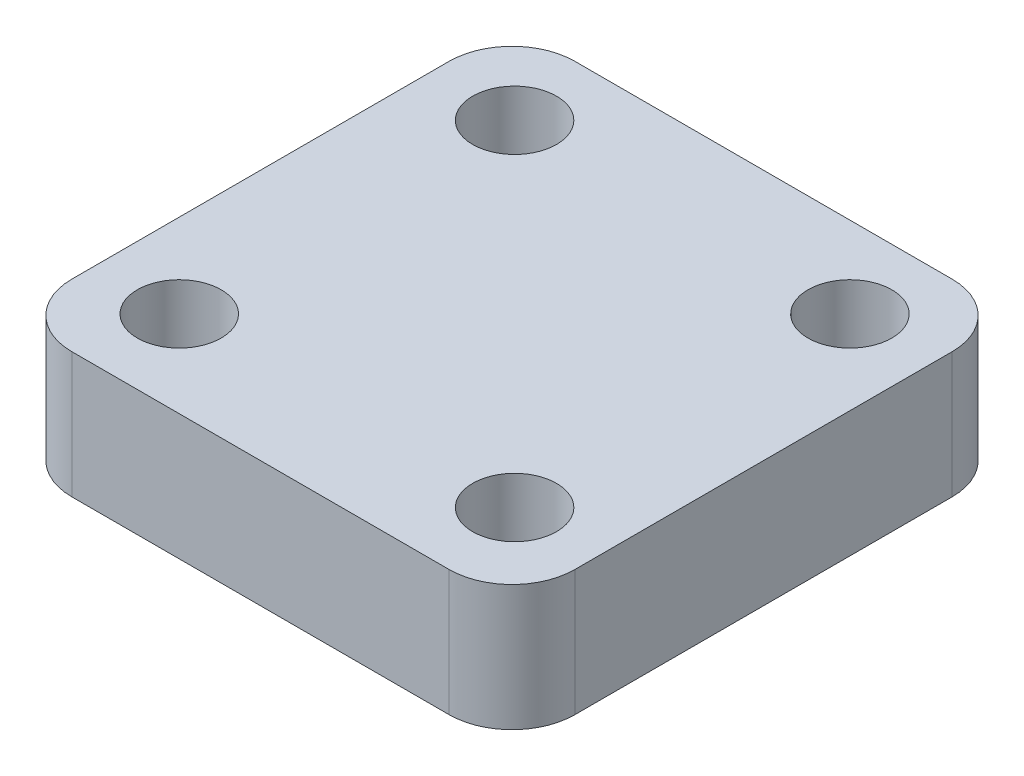
ISO-10303-21;
HEADER;
FILE_DESCRIPTION(('STEP AP214'),'2;1');
FILE_NAME('part.step','',(''),(''),'','','');
FILE_SCHEMA(('AUTOMOTIVE_DESIGN { 1 0 10303 214 1 1 1 1 }'));
ENDSEC;
DATA;
#1=APPLICATION_CONTEXT('core data for automotive mechanical design processes');
#2=APPLICATION_PROTOCOL_DEFINITION('international standard','automotive_design',2000,#1);
#3=PRODUCT_CONTEXT('',#1,'mechanical');
#4=PRODUCT('Part','Part','',(#3));
#5=PRODUCT_RELATED_PRODUCT_CATEGORY('part','',(#4));
#6=PRODUCT_DEFINITION_FORMATION('','',#4);
#7=PRODUCT_DEFINITION_CONTEXT('part definition',#1,'design');
#8=PRODUCT_DEFINITION('design','',#6,#7);
#9=PRODUCT_DEFINITION_SHAPE('','',#8);
#10=(LENGTH_UNIT() NAMED_UNIT(*) SI_UNIT(.MILLI.,.METRE.));
#11=(NAMED_UNIT(*) PLANE_ANGLE_UNIT() SI_UNIT($,.RADIAN.));
#12=(NAMED_UNIT(*) SI_UNIT($,.STERADIAN.) SOLID_ANGLE_UNIT());
#13=UNCERTAINTY_MEASURE_WITH_UNIT(LENGTH_MEASURE(1.E-05),#10,'distance_accuracy_value','');
#14=(GEOMETRIC_REPRESENTATION_CONTEXT(3) GLOBAL_UNCERTAINTY_ASSIGNED_CONTEXT((#13)) GLOBAL_UNIT_ASSIGNED_CONTEXT((#10,
#11,#12)) REPRESENTATION_CONTEXT('',''));
#15=CARTESIAN_POINT('',(0.,0.,0.));
#16=DIRECTION('',(0.,0.,1.));
#17=DIRECTION('',(1.,0.,0.));
#18=AXIS2_PLACEMENT_3D('',#15,#16,#17);
#19=CARTESIAN_POINT('',(450.,300.,-450.));
#20=DIRECTION('',(0.,1.,0.));
#21=DIRECTION('',(0.,0.,1.));
#22=AXIS2_PLACEMENT_3D('',#19,#20,#21);
#23=PLANE('',#22);
#24=CARTESIAN_POINT('',(-400.,300.,393.8285187875));
#25=DIRECTION('',(0.,1.,0.));
#26=DIRECTION('',(0.,0.,1.));
#27=AXIS2_PLACEMENT_3D('',#24,#25,#26);
#28=CIRCLE('',#27,100.);
#29=CARTESIAN_POINT('',(-400.,300.,493.8285187875));
#30=VERTEX_POINT('',#29);
#31=EDGE_CURVE('E188',#30,#30,#28,.T.);
#32=ORIENTED_EDGE('',*,*,#31,.F.);
#33=EDGE_LOOP('',(#32));
#34=FACE_BOUND('',#33,.T.);
#35=CARTESIAN_POINT('',(-400.,300.,-406.1714812125));
#36=DIRECTION('',(0.,1.,0.));
#37=DIRECTION('',(0.,0.,1.));
#38=AXIS2_PLACEMENT_3D('',#35,#36,#37);
#39=CIRCLE('',#38,100.);
#40=CARTESIAN_POINT('',(-400.,300.,-306.1714812125));
#41=VERTEX_POINT('',#40);
#42=EDGE_CURVE('E134',#41,#41,#39,.T.);
#43=ORIENTED_EDGE('',*,*,#42,.F.);
#44=EDGE_LOOP('',(#43));
#45=FACE_BOUND('',#44,.T.);
#46=CARTESIAN_POINT('',(450.,300.,-450.));
#47=DIRECTION('',(0.,1.,0.));
#48=DIRECTION('',(0.,0.,1.));
#49=AXIS2_PLACEMENT_3D('',#46,#47,#48);
#50=CIRCLE('',#49,150.);
#51=CARTESIAN_POINT('',(600.,300.,-449.999999999999));
#52=VERTEX_POINT('',#51);
#53=CARTESIAN_POINT('',(449.999999999999,300.,-600.));
#54=VERTEX_POINT('',#53);
#55=EDGE_CURVE('E145',#52,#54,#50,.T.);
#56=ORIENTED_EDGE('',*,*,#55,.T.);
#57=DIRECTION('',(-1.,0.,0.));
#58=VECTOR('',#57,1.);
#59=CARTESIAN_POINT('',(-449.999999999999,300.,-600.));
#60=LINE('',#59,#58);
#61=CARTESIAN_POINT('',(-450.,300.,-600.));
#62=VERTEX_POINT('',#61);
#63=EDGE_CURVE('E93',#54,#62,#60,.T.);
#64=ORIENTED_EDGE('',*,*,#63,.T.);
#65=CARTESIAN_POINT('',(-450.,300.,-450.));
#66=DIRECTION('',(0.,1.,0.));
#67=DIRECTION('',(0.,0.,-1.));
#68=AXIS2_PLACEMENT_3D('',#65,#66,#67);
#69=CIRCLE('',#68,150.);
#70=CARTESIAN_POINT('',(-600.,300.,-449.999999999999));
#71=VERTEX_POINT('',#70);
#72=EDGE_CURVE('E160',#62,#71,#69,.T.);
#73=ORIENTED_EDGE('',*,*,#72,.T.);
#74=DIRECTION('',(0.,0.,1.));
#75=VECTOR('',#74,1.);
#76=CARTESIAN_POINT('',(-600.,300.,-449.999999999999));
#77=LINE('',#76,#75);
#78=CARTESIAN_POINT('',(-600.,300.,449.999999999999));
#79=VERTEX_POINT('',#78);
#80=EDGE_CURVE('E173',#71,#79,#77,.T.);
#81=ORIENTED_EDGE('',*,*,#80,.T.);
#82=CARTESIAN_POINT('',(-450.,300.,450.));
#83=DIRECTION('',(0.,1.,0.));
#84=DIRECTION('',(0.,0.,1.));
#85=AXIS2_PLACEMENT_3D('',#82,#83,#84);
#86=CIRCLE('',#85,150.);
#87=CARTESIAN_POINT('',(-449.999999999999,300.,600.));
#88=VERTEX_POINT('',#87);
#89=EDGE_CURVE('E112',#79,#88,#86,.T.);
#90=ORIENTED_EDGE('',*,*,#89,.T.);
#91=DIRECTION('',(1.,0.,0.));
#92=VECTOR('',#91,1.);
#93=CARTESIAN_POINT('',(-449.999999999999,300.,600.));
#94=LINE('',#93,#92);
#95=CARTESIAN_POINT('',(449.999999999999,300.,600.));
#96=VERTEX_POINT('',#95);
#97=EDGE_CURVE('E106',#88,#96,#94,.T.);
#98=ORIENTED_EDGE('',*,*,#97,.T.);
#99=CARTESIAN_POINT('',(450.,300.,450.));
#100=DIRECTION('',(0.,1.,0.));
#101=DIRECTION('',(0.,0.,-1.));
#102=AXIS2_PLACEMENT_3D('',#99,#100,#101);
#103=CIRCLE('',#102,150.);
#104=CARTESIAN_POINT('',(600.,300.,449.999999999999));
#105=VERTEX_POINT('',#104);
#106=EDGE_CURVE('E110',#96,#105,#103,.T.);
#107=ORIENTED_EDGE('',*,*,#106,.T.);
#108=DIRECTION('',(0.,0.,-1.));
#109=VECTOR('',#108,1.);
#110=CARTESIAN_POINT('',(600.,300.,-449.999999999999));
#111=LINE('',#110,#109);
#112=EDGE_CURVE('E50',#105,#52,#111,.T.);
#113=ORIENTED_EDGE('',*,*,#112,.T.);
#114=EDGE_LOOP('',(#56,#64,#73,#81,#90,#98,#107,#113));
#115=FACE_BOUND('',#114,.T.);
#116=CARTESIAN_POINT('',(400.,300.,-406.1714812125));
#117=DIRECTION('',(0.,1.,0.));
#118=DIRECTION('',(0.,0.,1.));
#119=AXIS2_PLACEMENT_3D('',#116,#117,#118);
#120=CIRCLE('',#119,100.);
#121=CARTESIAN_POINT('',(400.,300.,-306.1714812125));
#122=VERTEX_POINT('',#121);
#123=EDGE_CURVE('E182',#122,#122,#120,.T.);
#124=ORIENTED_EDGE('',*,*,#123,.F.);
#125=EDGE_LOOP('',(#124));
#126=FACE_BOUND('',#125,.T.);
#127=CARTESIAN_POINT('',(400.,300.,393.8285187875));
#128=DIRECTION('',(0.,1.,0.));
#129=DIRECTION('',(0.,0.,1.));
#130=AXIS2_PLACEMENT_3D('',#127,#128,#129);
#131=CIRCLE('',#130,100.);
#132=CARTESIAN_POINT('',(400.,300.,493.8285187875));
#133=VERTEX_POINT('',#132);
#134=EDGE_CURVE('E194',#133,#133,#131,.T.);
#135=ORIENTED_EDGE('',*,*,#134,.F.);
#136=EDGE_LOOP('',(#135));
#137=FACE_BOUND('',#136,.T.);
#138=ADVANCED_FACE('F33',(#34,#45,#115,#126,#137),#23,.T.);
#139=CARTESIAN_POINT('',(450.,0.,-450.));
#140=DIRECTION('',(0.,1.,0.));
#141=DIRECTION('',(0.,0.,1.));
#142=AXIS2_PLACEMENT_3D('',#139,#140,#141);
#143=PLANE('',#142);
#144=CARTESIAN_POINT('',(450.,0.,-450.));
#145=DIRECTION('',(0.,1.,0.));
#146=DIRECTION('',(0.,0.,1.));
#147=AXIS2_PLACEMENT_3D('',#144,#145,#146);
#148=CIRCLE('',#147,150.);
#149=CARTESIAN_POINT('',(600.,0.,-449.999999999999));
#150=VERTEX_POINT('',#149);
#151=CARTESIAN_POINT('',(449.999999999999,0.,-600.));
#152=VERTEX_POINT('',#151);
#153=EDGE_CURVE('E130',#150,#152,#148,.T.);
#154=ORIENTED_EDGE('',*,*,#153,.F.);
#155=DIRECTION('',(0.,0.,-1.));
#156=VECTOR('',#155,1.);
#157=CARTESIAN_POINT('',(600.,0.,-449.999999999999));
#158=LINE('',#157,#156);
#159=CARTESIAN_POINT('',(600.,0.,449.999999999999));
#160=VERTEX_POINT('',#159);
#161=EDGE_CURVE('E85',#160,#150,#158,.T.);
#162=ORIENTED_EDGE('',*,*,#161,.F.);
#163=CARTESIAN_POINT('',(450.,0.,450.));
#164=DIRECTION('',(0.,1.,0.));
#165=DIRECTION('',(0.,0.,-1.));
#166=AXIS2_PLACEMENT_3D('',#163,#164,#165);
#167=CIRCLE('',#166,150.);
#168=CARTESIAN_POINT('',(449.999999999999,0.,600.));
#169=VERTEX_POINT('',#168);
#170=EDGE_CURVE('E79',#169,#160,#167,.T.);
#171=ORIENTED_EDGE('',*,*,#170,.F.);
#172=DIRECTION('',(1.,0.,0.));
#173=VECTOR('',#172,1.);
#174=CARTESIAN_POINT('',(-449.999999999999,0.,600.));
#175=LINE('',#174,#173);
#176=CARTESIAN_POINT('',(-449.999999999999,0.,600.));
#177=VERTEX_POINT('',#176);
#178=EDGE_CURVE('E120',#177,#169,#175,.T.);
#179=ORIENTED_EDGE('',*,*,#178,.F.);
#180=CARTESIAN_POINT('',(-450.,0.,450.));
#181=DIRECTION('',(0.,1.,0.));
#182=DIRECTION('',(0.,0.,1.));
#183=AXIS2_PLACEMENT_3D('',#180,#181,#182);
#184=CIRCLE('',#183,150.);
#185=CARTESIAN_POINT('',(-600.,0.,449.999999999999));
#186=VERTEX_POINT('',#185);
#187=EDGE_CURVE('E140',#186,#177,#184,.T.);
#188=ORIENTED_EDGE('',*,*,#187,.F.);
#189=DIRECTION('',(0.,0.,1.));
#190=VECTOR('',#189,1.);
#191=CARTESIAN_POINT('',(-600.,0.,-449.999999999999));
#192=LINE('',#191,#190);
#193=CARTESIAN_POINT('',(-600.,0.,-449.999999999999));
#194=VERTEX_POINT('',#193);
#195=EDGE_CURVE('E138',#194,#186,#192,.T.);
#196=ORIENTED_EDGE('',*,*,#195,.F.);
#197=CARTESIAN_POINT('',(-450.,0.,-450.));
#198=DIRECTION('',(0.,1.,0.));
#199=DIRECTION('',(0.,0.,-1.));
#200=AXIS2_PLACEMENT_3D('',#197,#198,#199);
#201=CIRCLE('',#200,150.);
#202=CARTESIAN_POINT('',(-450.,0.,-600.));
#203=VERTEX_POINT('',#202);
#204=EDGE_CURVE('E136',#203,#194,#201,.T.);
#205=ORIENTED_EDGE('',*,*,#204,.F.);
#206=DIRECTION('',(-1.,0.,0.));
#207=VECTOR('',#206,1.);
#208=CARTESIAN_POINT('',(-449.999999999999,0.,-600.));
#209=LINE('',#208,#207);
#210=EDGE_CURVE('E133',#152,#203,#209,.T.);
#211=ORIENTED_EDGE('',*,*,#210,.F.);
#212=EDGE_LOOP('',(#154,#162,#171,#179,#188,#196,#205,#211));
#213=FACE_BOUND('',#212,.T.);
#214=CARTESIAN_POINT('',(-400.,0.,-406.1714812125));
#215=DIRECTION('',(0.,1.,0.));
#216=DIRECTION('',(0.,0.,1.));
#217=AXIS2_PLACEMENT_3D('',#214,#215,#216);
#218=CIRCLE('',#217,100.);
#219=CARTESIAN_POINT('',(-400.,0.,-306.1714812125));
#220=VERTEX_POINT('',#219);
#221=EDGE_CURVE('E179',#220,#220,#218,.T.);
#222=ORIENTED_EDGE('',*,*,#221,.T.);
#223=EDGE_LOOP('',(#222));
#224=FACE_BOUND('',#223,.T.);
#225=CARTESIAN_POINT('',(400.,0.,-406.1714812125));
#226=DIRECTION('',(0.,1.,0.));
#227=DIRECTION('',(0.,0.,1.));
#228=AXIS2_PLACEMENT_3D('',#225,#226,#227);
#229=CIRCLE('',#228,100.);
#230=CARTESIAN_POINT('',(400.,0.,-306.1714812125));
#231=VERTEX_POINT('',#230);
#232=EDGE_CURVE('E185',#231,#231,#229,.T.);
#233=ORIENTED_EDGE('',*,*,#232,.T.);
#234=EDGE_LOOP('',(#233));
#235=FACE_BOUND('',#234,.T.);
#236=CARTESIAN_POINT('',(-400.,0.,393.8285187875));
#237=DIRECTION('',(0.,1.,0.));
#238=DIRECTION('',(0.,0.,1.));
#239=AXIS2_PLACEMENT_3D('',#236,#237,#238);
#240=CIRCLE('',#239,100.);
#241=CARTESIAN_POINT('',(-400.,0.,493.8285187875));
#242=VERTEX_POINT('',#241);
#243=EDGE_CURVE('E191',#242,#242,#240,.T.);
#244=ORIENTED_EDGE('',*,*,#243,.T.);
#245=EDGE_LOOP('',(#244));
#246=FACE_BOUND('',#245,.T.);
#247=CARTESIAN_POINT('',(400.,0.,393.8285187875));
#248=DIRECTION('',(0.,1.,0.));
#249=DIRECTION('',(0.,0.,1.));
#250=AXIS2_PLACEMENT_3D('',#247,#248,#249);
#251=CIRCLE('',#250,100.);
#252=CARTESIAN_POINT('',(400.,0.,493.8285187875));
#253=VERTEX_POINT('',#252);
#254=EDGE_CURVE('E197',#253,#253,#251,.T.);
#255=ORIENTED_EDGE('',*,*,#254,.T.);
#256=EDGE_LOOP('',(#255));
#257=FACE_BOUND('',#256,.T.);
#258=ADVANCED_FACE('F164',(#213,#224,#235,#246,#257),#143,.F.);
#259=CARTESIAN_POINT('',(450.,300.,-450.));
#260=DIRECTION('',(0.,-1.,0.));
#261=DIRECTION('',(0.,0.,-1.));
#262=AXIS2_PLACEMENT_3D('',#259,#260,#261);
#263=CYLINDRICAL_SURFACE('',#262,150.);
#264=ORIENTED_EDGE('',*,*,#153,.T.);
#265=DIRECTION('',(0.,-1.,0.));
#266=VECTOR('',#265,1.);
#267=CARTESIAN_POINT('',(449.999999999999,300.,-600.));
#268=LINE('',#267,#266);
#269=EDGE_CURVE('E11',#54,#152,#268,.T.);
#270=ORIENTED_EDGE('',*,*,#269,.F.);
#271=ORIENTED_EDGE('',*,*,#55,.F.);
#272=DIRECTION('',(0.,-1.,0.));
#273=VECTOR('',#272,1.);
#274=CARTESIAN_POINT('',(600.,300.,-449.999999999999));
#275=LINE('',#274,#273);
#276=EDGE_CURVE('E126',#52,#150,#275,.T.);
#277=ORIENTED_EDGE('',*,*,#276,.T.);
#278=EDGE_LOOP('',(#264,#270,#271,#277));
#279=FACE_BOUND('',#278,.T.);
#280=ADVANCED_FACE('F35',(#279),#263,.T.);
#281=CARTESIAN_POINT('',(-449.999999999999,300.,-600.));
#282=DIRECTION('',(0.,0.,1.));
#283=DIRECTION('',(1.,0.,0.));
#284=AXIS2_PLACEMENT_3D('',#281,#282,#283);
#285=PLANE('',#284);
#286=ORIENTED_EDGE('',*,*,#210,.T.);
#287=DIRECTION('',(0.,-1.,0.));
#288=VECTOR('',#287,1.);
#289=CARTESIAN_POINT('',(-450.,300.,-600.));
#290=LINE('',#289,#288);
#291=EDGE_CURVE('E42',#62,#203,#290,.T.);
#292=ORIENTED_EDGE('',*,*,#291,.F.);
#293=ORIENTED_EDGE('',*,*,#63,.F.);
#294=ORIENTED_EDGE('',*,*,#269,.T.);
#295=EDGE_LOOP('',(#286,#292,#293,#294));
#296=FACE_BOUND('',#295,.T.);
#297=ADVANCED_FACE('F231',(#296),#285,.F.);
#298=CARTESIAN_POINT('',(-450.,300.,-450.));
#299=DIRECTION('',(0.,-1.,0.));
#300=DIRECTION('',(0.,0.,-1.));
#301=AXIS2_PLACEMENT_3D('',#298,#299,#300);
#302=CYLINDRICAL_SURFACE('',#301,150.);
#303=ORIENTED_EDGE('',*,*,#204,.T.);
#304=DIRECTION('',(0.,-1.,0.));
#305=VECTOR('',#304,1.);
#306=CARTESIAN_POINT('',(-600.,300.,-449.999999999999));
#307=LINE('',#306,#305);
#308=EDGE_CURVE('E152',#71,#194,#307,.T.);
#309=ORIENTED_EDGE('',*,*,#308,.F.);
#310=ORIENTED_EDGE('',*,*,#72,.F.);
#311=ORIENTED_EDGE('',*,*,#291,.T.);
#312=EDGE_LOOP('',(#303,#309,#310,#311));
#313=FACE_BOUND('',#312,.T.);
#314=ADVANCED_FACE('F158',(#313),#302,.T.);
#315=CARTESIAN_POINT('',(-600.,300.,-449.999999999999));
#316=DIRECTION('',(1.,0.,0.));
#317=DIRECTION('',(0.,0.,-1.));
#318=AXIS2_PLACEMENT_3D('',#315,#316,#317);
#319=PLANE('',#318);
#320=ORIENTED_EDGE('',*,*,#195,.T.);
#321=DIRECTION('',(0.,-1.,0.));
#322=VECTOR('',#321,1.);
#323=CARTESIAN_POINT('',(-600.,300.,449.999999999999));
#324=LINE('',#323,#322);
#325=EDGE_CURVE('E149',#79,#186,#324,.T.);
#326=ORIENTED_EDGE('',*,*,#325,.F.);
#327=ORIENTED_EDGE('',*,*,#80,.F.);
#328=ORIENTED_EDGE('',*,*,#308,.T.);
#329=EDGE_LOOP('',(#320,#326,#327,#328));
#330=FACE_BOUND('',#329,.T.);
#331=ADVANCED_FACE('F169',(#330),#319,.F.);
#332=CARTESIAN_POINT('',(-450.,300.,450.));
#333=DIRECTION('',(0.,-1.,0.));
#334=DIRECTION('',(0.,0.,-1.));
#335=AXIS2_PLACEMENT_3D('',#332,#333,#334);
#336=CYLINDRICAL_SURFACE('',#335,150.);
#337=ORIENTED_EDGE('',*,*,#187,.T.);
#338=DIRECTION('',(0.,-1.,0.));
#339=VECTOR('',#338,1.);
#340=CARTESIAN_POINT('',(-449.999999999999,300.,600.));
#341=LINE('',#340,#339);
#342=EDGE_CURVE('E121',#88,#177,#341,.T.);
#343=ORIENTED_EDGE('',*,*,#342,.F.);
#344=ORIENTED_EDGE('',*,*,#89,.F.);
#345=ORIENTED_EDGE('',*,*,#325,.T.);
#346=EDGE_LOOP('',(#337,#343,#344,#345));
#347=FACE_BOUND('',#346,.T.);
#348=ADVANCED_FACE('F172',(#347),#336,.T.);
#349=CARTESIAN_POINT('',(-449.999999999999,300.,600.));
#350=DIRECTION('',(0.,0.,-1.));
#351=DIRECTION('',(-1.,0.,0.));
#352=AXIS2_PLACEMENT_3D('',#349,#350,#351);
#353=PLANE('',#352);
#354=ORIENTED_EDGE('',*,*,#178,.T.);
#355=DIRECTION('',(0.,-1.,0.));
#356=VECTOR('',#355,1.);
#357=CARTESIAN_POINT('',(449.999999999999,300.,600.));
#358=LINE('',#357,#356);
#359=EDGE_CURVE('E117',#96,#169,#358,.T.);
#360=ORIENTED_EDGE('',*,*,#359,.F.);
#361=ORIENTED_EDGE('',*,*,#97,.F.);
#362=ORIENTED_EDGE('',*,*,#342,.T.);
#363=EDGE_LOOP('',(#354,#360,#361,#362));
#364=FACE_BOUND('',#363,.T.);
#365=ADVANCED_FACE('F118',(#364),#353,.F.);
#366=CARTESIAN_POINT('',(450.,300.,450.));
#367=DIRECTION('',(0.,-1.,0.));
#368=DIRECTION('',(0.,0.,-1.));
#369=AXIS2_PLACEMENT_3D('',#366,#367,#368);
#370=CYLINDRICAL_SURFACE('',#369,150.);
#371=ORIENTED_EDGE('',*,*,#170,.T.);
#372=DIRECTION('',(0.,-1.,0.));
#373=VECTOR('',#372,1.);
#374=CARTESIAN_POINT('',(600.,300.,449.999999999999));
#375=LINE('',#374,#373);
#376=EDGE_CURVE('E122',#105,#160,#375,.T.);
#377=ORIENTED_EDGE('',*,*,#376,.F.);
#378=ORIENTED_EDGE('',*,*,#106,.F.);
#379=ORIENTED_EDGE('',*,*,#359,.T.);
#380=EDGE_LOOP('',(#371,#377,#378,#379));
#381=FACE_BOUND('',#380,.T.);
#382=ADVANCED_FACE('F124',(#381),#370,.T.);
#383=CARTESIAN_POINT('',(600.,300.,-449.999999999999));
#384=DIRECTION('',(-1.,0.,0.));
#385=DIRECTION('',(0.,0.,1.));
#386=AXIS2_PLACEMENT_3D('',#383,#384,#385);
#387=PLANE('',#386);
#388=ORIENTED_EDGE('',*,*,#161,.T.);
#389=ORIENTED_EDGE('',*,*,#276,.F.);
#390=ORIENTED_EDGE('',*,*,#112,.F.);
#391=ORIENTED_EDGE('',*,*,#376,.T.);
#392=EDGE_LOOP('',(#388,#389,#390,#391));
#393=FACE_BOUND('',#392,.T.);
#394=ADVANCED_FACE('F219',(#393),#387,.F.);
#395=CARTESIAN_POINT('',(-400.,300.,-406.1714812125));
#396=DIRECTION('',(0.,-1.,0.));
#397=DIRECTION('',(0.,0.,-1.));
#398=AXIS2_PLACEMENT_3D('',#395,#396,#397);
#399=CYLINDRICAL_SURFACE('',#398,100.);
#400=ORIENTED_EDGE('',*,*,#42,.T.);
#401=EDGE_LOOP('',(#400));
#402=FACE_BOUND('',#401,.T.);
#403=ORIENTED_EDGE('',*,*,#221,.F.);
#404=EDGE_LOOP('',(#403));
#405=FACE_BOUND('',#404,.T.);
#406=ADVANCED_FACE('F216',(#402,#405),#399,.F.);
#407=CARTESIAN_POINT('',(400.,300.,-406.1714812125));
#408=DIRECTION('',(0.,-1.,0.));
#409=DIRECTION('',(0.,0.,-1.));
#410=AXIS2_PLACEMENT_3D('',#407,#408,#409);
#411=CYLINDRICAL_SURFACE('',#410,100.);
#412=ORIENTED_EDGE('',*,*,#123,.T.);
#413=EDGE_LOOP('',(#412));
#414=FACE_BOUND('',#413,.T.);
#415=ORIENTED_EDGE('',*,*,#232,.F.);
#416=EDGE_LOOP('',(#415));
#417=FACE_BOUND('',#416,.T.);
#418=ADVANCED_FACE('F295',(#414,#417),#411,.F.);
#419=CARTESIAN_POINT('',(-400.,300.,393.8285187875));
#420=DIRECTION('',(0.,-1.,0.));
#421=DIRECTION('',(0.,0.,-1.));
#422=AXIS2_PLACEMENT_3D('',#419,#420,#421);
#423=CYLINDRICAL_SURFACE('',#422,100.);
#424=ORIENTED_EDGE('',*,*,#31,.T.);
#425=EDGE_LOOP('',(#424));
#426=FACE_BOUND('',#425,.T.);
#427=ORIENTED_EDGE('',*,*,#243,.F.);
#428=EDGE_LOOP('',(#427));
#429=FACE_BOUND('',#428,.T.);
#430=ADVANCED_FACE('F303',(#426,#429),#423,.F.);
#431=CARTESIAN_POINT('',(400.,300.,393.8285187875));
#432=DIRECTION('',(0.,-1.,0.));
#433=DIRECTION('',(0.,0.,-1.));
#434=AXIS2_PLACEMENT_3D('',#431,#432,#433);
#435=CYLINDRICAL_SURFACE('',#434,100.);
#436=ORIENTED_EDGE('',*,*,#134,.T.);
#437=EDGE_LOOP('',(#436));
#438=FACE_BOUND('',#437,.T.);
#439=ORIENTED_EDGE('',*,*,#254,.F.);
#440=EDGE_LOOP('',(#439));
#441=FACE_BOUND('',#440,.T.);
#442=ADVANCED_FACE('F203',(#438,#441),#435,.F.);
#443=CLOSED_SHELL('',(#138,#258,#280,#297,#314,#331,#348,#365,#382,#394,#406,#418,#430,#442));
#444=MANIFOLD_SOLID_BREP('B2',#443);
#445=ADVANCED_BREP_SHAPE_REPRESENTATION('',(#18,#444),#14);
#446=SHAPE_DEFINITION_REPRESENTATION(#9,#445);
ENDSEC;
END-ISO-10303-21;
